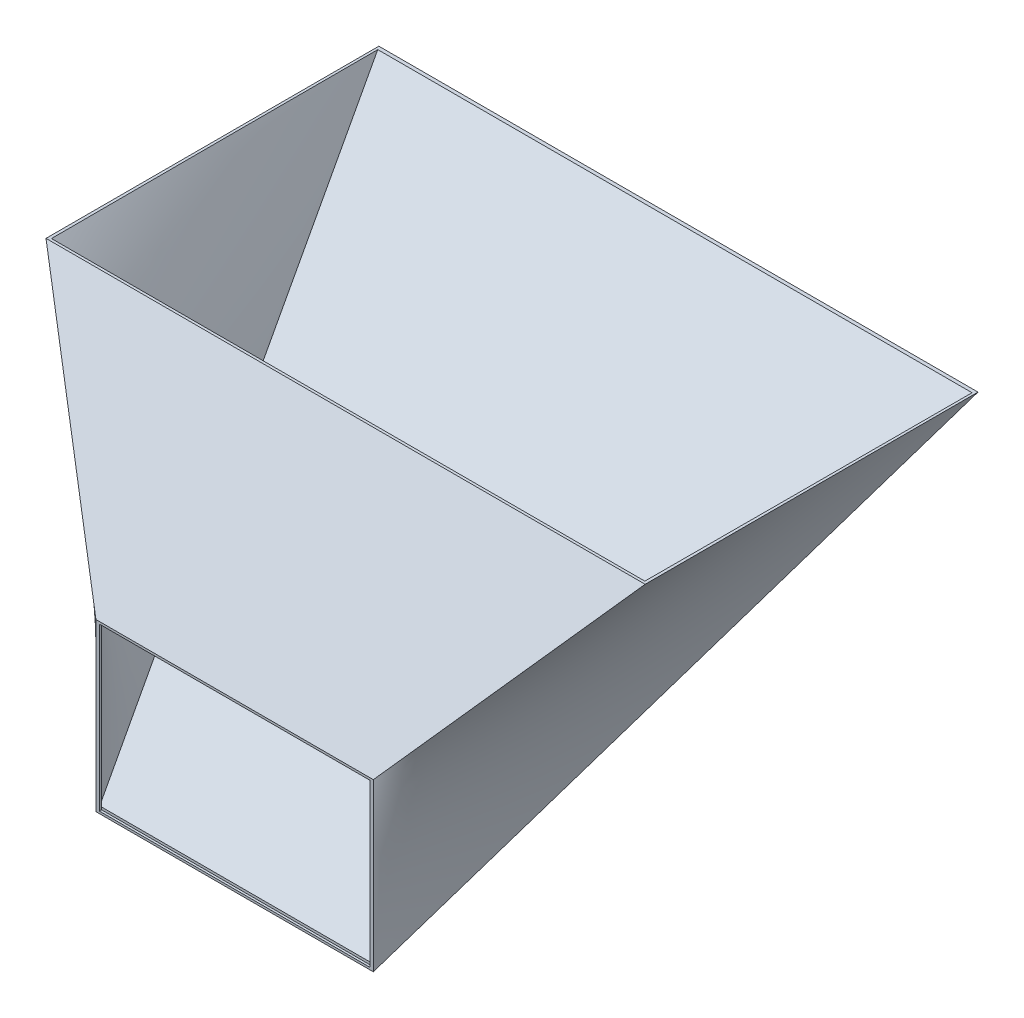
ISO-10303-21;
HEADER;
FILE_DESCRIPTION(('STEP AP214'),'2;1');
FILE_NAME('part.step','',(''),(''),'','','');
FILE_SCHEMA(('AUTOMOTIVE_DESIGN { 1 0 10303 214 1 1 1 1 }'));
ENDSEC;
DATA;
#1=APPLICATION_CONTEXT('core data for automotive mechanical design processes');
#2=APPLICATION_PROTOCOL_DEFINITION('international standard','automotive_design',2000,#1);
#3=PRODUCT_CONTEXT('',#1,'mechanical');
#4=PRODUCT('Part','Part','',(#3));
#5=PRODUCT_RELATED_PRODUCT_CATEGORY('part','',(#4));
#6=PRODUCT_DEFINITION_FORMATION('','',#4);
#7=PRODUCT_DEFINITION_CONTEXT('part definition',#1,'design');
#8=PRODUCT_DEFINITION('design','',#6,#7);
#9=PRODUCT_DEFINITION_SHAPE('','',#8);
#10=(LENGTH_UNIT() NAMED_UNIT(*) SI_UNIT(.MILLI.,.METRE.));
#11=(NAMED_UNIT(*) PLANE_ANGLE_UNIT() SI_UNIT($,.RADIAN.));
#12=(NAMED_UNIT(*) SI_UNIT($,.STERADIAN.) SOLID_ANGLE_UNIT());
#13=UNCERTAINTY_MEASURE_WITH_UNIT(LENGTH_MEASURE(1.E-05),#10,'distance_accuracy_value','');
#14=(GEOMETRIC_REPRESENTATION_CONTEXT(3) GLOBAL_UNCERTAINTY_ASSIGNED_CONTEXT((#13)) GLOBAL_UNIT_ASSIGNED_CONTEXT((#10,
#11,#12)) REPRESENTATION_CONTEXT('',''));
#15=CARTESIAN_POINT('',(0.,0.,0.));
#16=DIRECTION('',(0.,0.,1.));
#17=DIRECTION('',(1.,0.,0.));
#18=AXIS2_PLACEMENT_3D('',#15,#16,#17);
#19=CARTESIAN_POINT('',(0.,0.,0.));
#20=DIRECTION('',(0.,-1.,0.));
#21=DIRECTION('',(0.,0.,-1.));
#22=AXIS2_PLACEMENT_3D('',#19,#20,#21);
#23=PLANE('',#22);
#24=DIRECTION('',(0.,0.,-1.));
#25=VECTOR('',#24,1.);
#26=CARTESIAN_POINT('',(270.,0.,150.));
#27=LINE('',#26,#25);
#28=CARTESIAN_POINT('',(270.,0.,150.));
#29=VERTEX_POINT('',#28);
#30=CARTESIAN_POINT('',(270.,0.,-150.));
#31=VERTEX_POINT('',#30);
#32=EDGE_CURVE('E217',#29,#31,#27,.T.);
#33=ORIENTED_EDGE('',*,*,#32,.T.);
#34=DIRECTION('',(-1.,0.,0.));
#35=VECTOR('',#34,1.);
#36=CARTESIAN_POINT('',(-270.,0.,-150.));
#37=LINE('',#36,#35);
#38=CARTESIAN_POINT('',(-270.,0.,-150.));
#39=VERTEX_POINT('',#38);
#40=EDGE_CURVE('E361',#31,#39,#37,.T.);
#41=ORIENTED_EDGE('',*,*,#40,.T.);
#42=DIRECTION('',(0.,0.,1.));
#43=VECTOR('',#42,1.);
#44=CARTESIAN_POINT('',(-270.,0.,150.));
#45=LINE('',#44,#43);
#46=CARTESIAN_POINT('',(-270.,0.,150.));
#47=VERTEX_POINT('',#46);
#48=EDGE_CURVE('E592',#39,#47,#45,.T.);
#49=ORIENTED_EDGE('',*,*,#48,.T.);
#50=DIRECTION('',(1.,0.,0.));
#51=VECTOR('',#50,1.);
#52=CARTESIAN_POINT('',(-270.,0.,150.));
#53=LINE('',#52,#51);
#54=EDGE_CURVE('E286',#47,#29,#53,.T.);
#55=ORIENTED_EDGE('',*,*,#54,.T.);
#56=EDGE_LOOP('',(#33,#41,#49,#55));
#57=FACE_BOUND('',#56,.T.);
#58=CARTESIAN_POINT('',(267.411756298249,0.,147.6964977862));
#59=CARTESIAN_POINT('',(267.434846643851,0.,139.897678665111));
#60=CARTESIAN_POINT('',(267.455997240212,0.,132.098854111055));
#61=CARTESIAN_POINT('',(267.495069056526,0.,116.501197321535));
#62=CARTESIAN_POINT('',(267.512990276668,0.,108.702365086072));
#63=CARTESIAN_POINT('',(267.546253461856,0.,93.1046967574938));
#64=CARTESIAN_POINT('',(267.561595427414,0.,85.3058606643799));
#65=CARTESIAN_POINT('',(267.5901560998,0.,69.7081844888913));
#66=CARTESIAN_POINT('',(267.603374806591,0.,61.9093444065165));
#67=CARTESIAN_POINT('',(267.642244846355,0.,37.3656118596017));
#68=CARTESIAN_POINT('',(267.664763965878,0.,20.6207144494967));
#69=CARTESIAN_POINT('',(267.704377602569,0.,-12.8690880773957));
#70=CARTESIAN_POINT('',(267.721472119209,0.,-29.6139931941837));
#71=CARTESIAN_POINT('',(267.75182535049,0.,-63.1038122885919));
#72=CARTESIAN_POINT('',(267.765084063886,0.,-79.8487262662132));
#73=CARTESIAN_POINT('',(267.782886903814,0.,-104.966097303276));
#74=CARTESIAN_POINT('',(267.788473645064,0.,-113.338553655206));
#75=CARTESIAN_POINT('',(267.799043882002,0.,-130.083466718732));
#76=CARTESIAN_POINT('',(267.804027377692,0.,-138.455923430327));
#77=CARTESIAN_POINT('',(267.808755165928,0.,-146.828380287986));
#78=B_SPLINE_CURVE_WITH_KNOTS('',3,(#58,#59,#60,#61,#62,#63,#64,#65,#66,#67,#68,#69,#70,#71,#72,
#73,#74,#75,#76,#77),.UNSPECIFIED.,.F.,.F.,(4,2,2,2,2,2,2,2,2,4),(0.,23.3965592214482,
46.7931170839477,70.1896703108709,93.5862239371942,143.820960065194,194.055701082651,
244.290458415864,269.4078330493,294.525207616022),.UNSPECIFIED.);
#79=CARTESIAN_POINT('',(267.411756298249,0.,147.6964977862));
#80=VERTEX_POINT('',#79);
#81=CARTESIAN_POINT('',(267.808755165928,0.,-146.828380287986));
#82=VERTEX_POINT('',#81);
#83=EDGE_CURVE('E178',#80,#82,#78,.T.);
#84=ORIENTED_EDGE('',*,*,#83,.F.);
#85=DIRECTION('',(1.,0.,0.));
#86=VECTOR('',#85,1.);
#87=CARTESIAN_POINT('',(0.,0.,147.6964977862));
#88=LINE('',#87,#86);
#89=CARTESIAN_POINT('',(-267.411756298249,0.,147.6964977862));
#90=VERTEX_POINT('',#89);
#91=EDGE_CURVE('E227',#90,#80,#88,.T.);
#92=ORIENTED_EDGE('',*,*,#91,.F.);
#93=CARTESIAN_POINT('',(-267.808755165928,0.,-146.828380287986));
#94=CARTESIAN_POINT('',(-267.804134333256,0.,-138.647128529101));
#95=CARTESIAN_POINT('',(-267.799270860808,0.,-130.465876900697));
#96=CARTESIAN_POINT('',(-267.788969943614,0.,-114.103374012104));
#97=CARTESIAN_POINT('',(-267.783532498869,0.,-105.922122751915));
#98=CARTESIAN_POINT('',(-267.771994944348,0.,-89.5596207203461));
#99=CARTESIAN_POINT('',(-267.765894834573,0.,-81.3783699489672));
#100=CARTESIAN_POINT('',(-267.752920109484,0.,-65.0158713512886));
#101=CARTESIAN_POINT('',(-267.74604549439,0.,-56.8346235249888));
#102=CARTESIAN_POINT('',(-267.731387054738,0.,-40.4721286503037));
#103=CARTESIAN_POINT('',(-267.723603230176,0.,-32.2908816019184));
#104=CARTESIAN_POINT('',(-267.706960944255,0.,-15.9283884652603));
#105=CARTESIAN_POINT('',(-267.698102482879,0.,-7.74714237698738));
#106=CARTESIAN_POINT('',(-267.679106682879,0.,8.61535597827035));
#107=CARTESIAN_POINT('',(-267.668969343059,0.,16.7966082452539));
#108=CARTESIAN_POINT('',(-267.647160753254,0.,33.1591106511168));
#109=CARTESIAN_POINT('',(-267.635489503288,0.,41.3403607899962));
#110=CARTESIAN_POINT('',(-267.610293072754,0.,57.702857952949));
#111=CARTESIAN_POINT('',(-267.596767892252,0.,65.8841049770225));
#112=CARTESIAN_POINT('',(-267.567451362068,0.,82.2465972368752));
#113=CARTESIAN_POINT('',(-267.551660011764,0.,90.4278424726534));
#114=CARTESIAN_POINT('',(-267.517296777922,0.,106.790327473792));
#115=CARTESIAN_POINT('',(-267.498724894297,0.,114.971567239153));
#116=CARTESIAN_POINT('',(-267.458063294715,0.,131.334039242769));
#117=CARTESIAN_POINT('',(-267.435973578213,0.,139.515271481024));
#118=CARTESIAN_POINT('',(-267.411756298249,0.,147.6964977862));
#119=B_SPLINE_CURVE_WITH_KNOTS('',3,(#93,#94,#95,#96,#97,#98,#99,#100,#101,#102,#103,#104,#105,
#106,#107,#108,#109,#110,#111,#112,#113,#114,#115,#116,#117,#118),.UNSPECIFIED.,.F.,.F.,(4,2,2,
2,2,2,2,2,2,2,2,2,4),(0.,24.5437591976562,49.087518377804,73.6312774828969,98.1750295842546,
122.718781778726,147.26253434819,171.806309871532,196.350085093989,220.893859443495,
245.437640523055,269.981422361879,294.525208003884),.UNSPECIFIED.);
#120=CARTESIAN_POINT('',(-267.808755165928,0.,-146.828380287986));
#121=VERTEX_POINT('',#120);
#122=EDGE_CURVE('E258',#121,#90,#119,.T.);
#123=ORIENTED_EDGE('',*,*,#122,.F.);
#124=DIRECTION('',(-1.,0.,0.));
#125=VECTOR('',#124,1.);
#126=CARTESIAN_POINT('',(0.,0.,-146.828380287986));
#127=LINE('',#126,#125);
#128=EDGE_CURVE('E266',#82,#121,#127,.T.);
#129=ORIENTED_EDGE('',*,*,#128,.F.);
#130=EDGE_LOOP('',(#84,#92,#123,#129));
#131=FACE_BOUND('',#130,.T.);
#132=ADVANCED_FACE('F42',(#57,#131),#23,.F.);
#133=CARTESIAN_POINT('',(0.,0.,250.));
#134=DIRECTION('',(0.,0.,-1.));
#135=DIRECTION('',(-1.,0.,0.));
#136=AXIS2_PLACEMENT_3D('',#133,#134,#135);
#137=PLANE('',#136);
#138=DIRECTION('',(-1.,0.,0.));
#139=VECTOR('',#138,1.);
#140=CARTESIAN_POINT('',(-122.,-176.999999999998,250.));
#141=LINE('',#140,#139);
#142=CARTESIAN_POINT('',(122.,-176.999999999998,250.));
#143=VERTEX_POINT('',#142);
#144=CARTESIAN_POINT('',(-122.,-176.999999999998,250.));
#145=VERTEX_POINT('',#144);
#146=EDGE_CURVE('E172',#143,#145,#141,.T.);
#147=ORIENTED_EDGE('',*,*,#146,.F.);
#148=DIRECTION('',(0.,1.,0.));
#149=VECTOR('',#148,1.);
#150=CARTESIAN_POINT('',(122.,-322.999999999997,250.));
#151=LINE('',#150,#149);
#152=CARTESIAN_POINT('',(122.,-322.999999999997,250.));
#153=VERTEX_POINT('',#152);
#154=EDGE_CURVE('E61',#153,#143,#151,.T.);
#155=ORIENTED_EDGE('',*,*,#154,.F.);
#156=DIRECTION('',(1.,0.,0.));
#157=VECTOR('',#156,1.);
#158=CARTESIAN_POINT('',(-122.,-322.999999999997,250.));
#159=LINE('',#158,#157);
#160=CARTESIAN_POINT('',(-122.,-322.999999999997,250.));
#161=VERTEX_POINT('',#160);
#162=EDGE_CURVE('E162',#161,#153,#159,.T.);
#163=ORIENTED_EDGE('',*,*,#162,.F.);
#164=DIRECTION('',(0.,-1.,0.));
#165=VECTOR('',#164,1.);
#166=CARTESIAN_POINT('',(-122.,-322.999999999997,250.));
#167=LINE('',#166,#165);
#168=EDGE_CURVE('E165',#145,#161,#167,.T.);
#169=ORIENTED_EDGE('',*,*,#168,.F.);
#170=EDGE_LOOP('',(#147,#155,#163,#169));
#171=FACE_BOUND('',#170,.T.);
#172=DIRECTION('',(0.,1.,0.));
#173=VECTOR('',#172,1.);
#174=CARTESIAN_POINT('',(125.,-324.999999999997,250.));
#175=LINE('',#174,#173);
#176=CARTESIAN_POINT('',(125.,-324.999999999997,250.));
#177=VERTEX_POINT('',#176);
#178=CARTESIAN_POINT('',(125.,-174.999999999998,250.));
#179=VERTEX_POINT('',#178);
#180=EDGE_CURVE('E372',#177,#179,#175,.T.);
#181=ORIENTED_EDGE('',*,*,#180,.T.);
#182=DIRECTION('',(-1.,0.,0.));
#183=VECTOR('',#182,1.);
#184=CARTESIAN_POINT('',(-125.,-174.999999999997,250.));
#185=LINE('',#184,#183);
#186=CARTESIAN_POINT('',(-125.,-174.999999999997,250.));
#187=VERTEX_POINT('',#186);
#188=EDGE_CURVE('E409',#179,#187,#185,.T.);
#189=ORIENTED_EDGE('',*,*,#188,.T.);
#190=DIRECTION('',(0.,-1.,0.));
#191=VECTOR('',#190,1.);
#192=CARTESIAN_POINT('',(-125.,-324.999999999997,250.));
#193=LINE('',#192,#191);
#194=CARTESIAN_POINT('',(-125.,-324.999999999997,250.));
#195=VERTEX_POINT('',#194);
#196=EDGE_CURVE('E53',#187,#195,#193,.T.);
#197=ORIENTED_EDGE('',*,*,#196,.T.);
#198=DIRECTION('',(1.,0.,0.));
#199=VECTOR('',#198,1.);
#200=CARTESIAN_POINT('',(-125.,-324.999999999997,250.));
#201=LINE('',#200,#199);
#202=EDGE_CURVE('E12',#195,#177,#201,.T.);
#203=ORIENTED_EDGE('',*,*,#202,.T.);
#204=EDGE_LOOP('',(#181,#189,#197,#203));
#205=FACE_BOUND('',#204,.T.);
#206=ADVANCED_FACE('F44',(#171,#205),#137,.F.);
#207=CARTESIAN_POINT('',(0.,64.6153846153851,113.076923076922));
#208=DIRECTION('',(0.,-0.496138938356839,-0.868243142124456));
#209=DIRECTION('',(0.,0.868243142124456,-0.496138938356839));
#210=AXIS2_PLACEMENT_3D('',#207,#208,#209);
#211=PLANE('',#210);
#212=DIRECTION('',(0.583984690219175,-0.704809108885201,0.402748062220121));
#213=VECTOR('',#212,1.);
#214=CARTESIAN_POINT('',(-270.,0.,150.));
#215=LINE('',#214,#213);
#216=EDGE_CURVE('E291',#47,#187,#215,.T.);
#217=ORIENTED_EDGE('',*,*,#216,.T.);
#218=ORIENTED_EDGE('',*,*,#188,.F.);
#219=DIRECTION('',(-0.583984690219175,-0.704809108885201,0.402748062220121));
#220=VECTOR('',#219,1.);
#221=CARTESIAN_POINT('',(270.,0.,150.));
#222=LINE('',#221,#220);
#223=EDGE_CURVE('E353',#29,#179,#222,.T.);
#224=ORIENTED_EDGE('',*,*,#223,.F.);
#225=ORIENTED_EDGE('',*,*,#54,.F.);
#226=EDGE_LOOP('',(#217,#218,#224,#225));
#227=FACE_BOUND('',#226,.T.);
#228=ADVANCED_FACE('F293',(#227),#211,.F.);
#229=CARTESIAN_POINT('',(270.,0.,-150.));
#230=CARTESIAN_POINT('',(125.,-324.999999999997,250.));
#231=CARTESIAN_POINT('',(270.,0.,-100.));
#232=CARTESIAN_POINT('',(125.,-299.999999999998,250.));
#233=CARTESIAN_POINT('',(270.,0.,-50.0000000000001));
#234=CARTESIAN_POINT('',(125.,-274.999999999998,250.));
#235=CARTESIAN_POINT('',(270.,0.,49.9999999999999));
#236=CARTESIAN_POINT('',(125.,-224.999999999998,250.));
#237=CARTESIAN_POINT('',(270.,0.,99.9999999999999));
#238=CARTESIAN_POINT('',(125.,-199.999999999998,250.));
#239=CARTESIAN_POINT('',(270.,0.,150.));
#240=CARTESIAN_POINT('',(125.,-174.999999999997,250.));
#241=B_SPLINE_SURFACE_WITH_KNOTS('',3,1,((#229,#230),(#231,#232),(#233,#234),(#235,#236),(#237,
#238),(#239,#240)),.UNSPECIFIED.,.F.,.F.,.F.,(4,2,4),(2,2),(0.,0.5,1.),(0.,1.),.UNSPECIFIED.);
#242=DIRECTION('',(-0.270827043762255,-0.607026132570567,0.747109086240703));
#243=VECTOR('',#242,1.);
#244=CARTESIAN_POINT('',(270.,0.,-150.));
#245=LINE('',#244,#243);
#246=EDGE_CURVE('E352',#31,#177,#245,.T.);
#247=ORIENTED_EDGE('',*,*,#32,.F.);
#248=ORIENTED_EDGE('',*,*,#223,.T.);
#249=ORIENTED_EDGE('',*,*,#180,.F.);
#250=ORIENTED_EDGE('',*,*,#246,.F.);
#251=EDGE_LOOP('',(#247,#248,#249,#250));
#252=FACE_BOUND('',#251,.T.);
#253=ADVANCED_FACE('F271',(#252),#241,.T.);
#254=CARTESIAN_POINT('',(-270.,0.,150.));
#255=CARTESIAN_POINT('',(-125.,-174.999999999997,250.));
#256=CARTESIAN_POINT('',(-270.,0.,100.));
#257=CARTESIAN_POINT('',(-125.,-199.999999999998,250.));
#258=CARTESIAN_POINT('',(-270.,0.,50.));
#259=CARTESIAN_POINT('',(-125.,-224.999999999998,250.));
#260=CARTESIAN_POINT('',(-270.,0.,-50.));
#261=CARTESIAN_POINT('',(-125.,-274.999999999998,250.));
#262=CARTESIAN_POINT('',(-270.,0.,-100.));
#263=CARTESIAN_POINT('',(-125.,-299.999999999998,250.));
#264=CARTESIAN_POINT('',(-270.,0.,-150.));
#265=CARTESIAN_POINT('',(-125.,-324.999999999997,250.));
#266=B_SPLINE_SURFACE_WITH_KNOTS('',3,1,((#254,#255),(#256,#257),(#258,#259),(#260,#261),(#262,
#263),(#264,#265)),.UNSPECIFIED.,.F.,.F.,.F.,(4,2,4),(2,2),(0.,0.5,1.),(0.,1.),.UNSPECIFIED.);
#267=DIRECTION('',(0.270827043762255,-0.607026132570567,0.747109086240703));
#268=VECTOR('',#267,1.);
#269=CARTESIAN_POINT('',(-197.5,-162.499999999999,50.));
#270=LINE('',#269,#268);
#271=EDGE_CURVE('E345',#39,#195,#270,.T.);
#272=ORIENTED_EDGE('',*,*,#48,.F.);
#273=ORIENTED_EDGE('',*,*,#271,.T.);
#274=ORIENTED_EDGE('',*,*,#196,.F.);
#275=ORIENTED_EDGE('',*,*,#216,.F.);
#276=EDGE_LOOP('',(#272,#273,#274,#275));
#277=FACE_BOUND('',#276,.T.);
#278=ADVANCED_FACE('F322',(#277),#266,.T.);
#279=CARTESIAN_POINT('',(0.,-73.4117647058823,-59.6470588235289));
#280=DIRECTION('',(0.,0.776114000116268,0.630592625094463));
#281=DIRECTION('',(0.,-0.630592625094463,0.776114000116268));
#282=AXIS2_PLACEMENT_3D('',#279,#280,#281);
#283=PLANE('',#282);
#284=ORIENTED_EDGE('',*,*,#246,.T.);
#285=ORIENTED_EDGE('',*,*,#202,.F.);
#286=ORIENTED_EDGE('',*,*,#271,.F.);
#287=ORIENTED_EDGE('',*,*,#40,.F.);
#288=EDGE_LOOP('',(#284,#285,#286,#287));
#289=FACE_BOUND('',#288,.T.);
#290=ADVANCED_FACE('F202',(#289),#283,.F.);
#291=CARTESIAN_POINT('',(0.,0.,248.));
#292=DIRECTION('',(0.,0.,-1.));
#293=DIRECTION('',(-1.,0.,0.));
#294=AXIS2_PLACEMENT_3D('',#291,#292,#293);
#295=PLANE('',#294);
#296=DIRECTION('',(0.,1.,0.));
#297=VECTOR('',#296,1.);
#298=CARTESIAN_POINT('',(122.,-322.999999999997,248.));
#299=LINE('',#298,#297);
#300=CARTESIAN_POINT('',(122.,-320.798058983986,248.));
#301=VERTEX_POINT('',#300);
#302=CARTESIAN_POINT('',(122.,-176.999999999998,248.));
#303=VERTEX_POINT('',#302);
#304=EDGE_CURVE('E142',#301,#303,#299,.T.);
#305=ORIENTED_EDGE('',*,*,#304,.T.);
#306=DIRECTION('',(-1.,0.,0.));
#307=VECTOR('',#306,1.);
#308=CARTESIAN_POINT('',(-122.,-176.999999999998,248.));
#309=LINE('',#308,#307);
#310=CARTESIAN_POINT('',(-122.,-176.999999999998,248.));
#311=VERTEX_POINT('',#310);
#312=EDGE_CURVE('E151',#303,#311,#309,.T.);
#313=ORIENTED_EDGE('',*,*,#312,.T.);
#314=DIRECTION('',(0.,-1.,0.));
#315=VECTOR('',#314,1.);
#316=CARTESIAN_POINT('',(-122.,-322.999999999997,248.));
#317=LINE('',#316,#315);
#318=CARTESIAN_POINT('',(-122.,-320.798058983986,248.));
#319=VERTEX_POINT('',#318);
#320=EDGE_CURVE('E168',#311,#319,#317,.T.);
#321=ORIENTED_EDGE('',*,*,#320,.T.);
#322=DIRECTION('',(1.,0.,0.));
#323=VECTOR('',#322,1.);
#324=CARTESIAN_POINT('',(0.,-320.798058983986,248.));
#325=LINE('',#324,#323);
#326=CARTESIAN_POINT('',(-123.605215125509,-320.798058983986,248.));
#327=VERTEX_POINT('',#326);
#328=EDGE_CURVE('E214',#327,#319,#325,.T.);
#329=ORIENTED_EDGE('',*,*,#328,.F.);
#330=CARTESIAN_POINT('',(-124.365259815684,-175.531128874147,248.));
#331=CARTESIAN_POINT('',(-124.328099579039,-179.160641786396,248.));
#332=CARTESIAN_POINT('',(-124.293082813377,-182.790176092988,248.));
#333=CARTESIAN_POINT('',(-124.226973659055,-190.049279416056,248.));
#334=CARTESIAN_POINT('',(-124.195881269212,-193.67884843252,248.));
#335=CARTESIAN_POINT('',(-124.107946895652,-204.567584982609,248.));
#336=CARTESIAN_POINT('',(-124.05644757007,-211.826795747455,248.));
#337=CARTESIAN_POINT('',(-123.964349647355,-226.345275370649,248.));
#338=CARTESIAN_POINT('',(-123.923751036982,-233.604544228916,248.));
#339=CARTESIAN_POINT('',(-123.850686066089,-248.123128953765,248.));
#340=CARTESIAN_POINT('',(-123.81821971312,-255.382444820383,248.));
#341=CARTESIAN_POINT('',(-123.769164027476,-267.488119495402,248.));
#342=CARTESIAN_POINT('',(-123.750884357462,-272.334471649066,248.));
#343=CARTESIAN_POINT('',(-123.716588829711,-282.027184119453,248.));
#344=CARTESIAN_POINT('',(-123.700572972047,-286.873544436176,248.));
#345=CARTESIAN_POINT('',(-123.670426011759,-296.566261566098,248.));
#346=CARTESIAN_POINT('',(-123.656294905519,-301.412618379287,248.));
#347=CARTESIAN_POINT('',(-123.629629444561,-311.105335952212,248.));
#348=CARTESIAN_POINT('',(-123.617095089689,-315.951696711949,248.));
#349=CARTESIAN_POINT('',(-123.605215125509,-320.798058983986,248.));
#350=B_SPLINE_CURVE_WITH_KNOTS('',3,(#330,#331,#332,#333,#334,#335,#336,#337,#338,#339,#340,
#341,#342,#343,#344,#345,#346,#347,#348,#349),.UNSPECIFIED.,.F.,.F.,(4,2,2,2,2,2,2,2,2,4),(0.,
10.8891079150919,21.7782125452057,43.5563806118691,65.3345222285689,87.1126840730327,
101.651843467233,116.191003329456,130.730135303088,145.269265890549),.UNSPECIFIED.);
#351=CARTESIAN_POINT('',(-124.365259815684,-175.531128874147,248.));
#352=VERTEX_POINT('',#351);
#353=EDGE_CURVE('E207',#352,#327,#350,.T.);
#354=ORIENTED_EDGE('',*,*,#353,.F.);
#355=DIRECTION('',(-1.,0.,0.));
#356=VECTOR('',#355,1.);
#357=CARTESIAN_POINT('',(0.,-175.531128874147,248.));
#358=LINE('',#357,#356);
#359=CARTESIAN_POINT('',(124.365259815684,-175.531128874147,248.));
#360=VERTEX_POINT('',#359);
#361=EDGE_CURVE('E191',#360,#352,#358,.T.);
#362=ORIENTED_EDGE('',*,*,#361,.F.);
#363=CARTESIAN_POINT('',(123.605215125509,-320.798058983986,248.));
#364=CARTESIAN_POINT('',(123.614768387001,-316.89864838447,248.));
#365=CARTESIAN_POINT('',(123.624752104755,-312.999238835381,248.));
#366=CARTESIAN_POINT('',(123.645718520142,-305.200422311509,248.));
#367=CARTESIAN_POINT('',(123.656701217803,-301.301015336727,248.));
#368=CARTESIAN_POINT('',(123.691354915018,-289.602787782247,248.));
#369=CARTESIAN_POINT('',(123.716731491314,-281.803972125973,248.));
#370=CARTESIAN_POINT('',(123.775027287759,-265.798908204825,248.));
#371=CARTESIAN_POINT('',(123.808271310441,-257.592661093171,248.));
#372=CARTESIAN_POINT('',(123.884010988496,-241.180216219091,248.));
#373=CARTESIAN_POINT('',(123.926506635373,-232.974018456627,248.));
#374=CARTESIAN_POINT('',(124.024391596907,-216.561627836242,248.));
#375=CARTESIAN_POINT('',(124.079781019693,-208.35543497894,248.));
#376=CARTESIAN_POINT('',(124.176093764621,-196.046240389759,248.));
#377=CARTESIAN_POINT('',(124.210402825031,-191.943186933849,248.));
#378=CARTESIAN_POINT('',(124.283977326941,-183.737122841055,248.));
#379=CARTESIAN_POINT('',(124.323242770528,-179.634112204189,248.));
#380=CARTESIAN_POINT('',(124.365259815684,-175.531128874147,248.));
#381=B_SPLINE_CURVE_WITH_KNOTS('',3,(#363,#364,#365,#366,#367,#368,#369,#370,#371,#372,#373,
#374,#375,#376,#377,#378,#379,#380),.UNSPECIFIED.,.F.,.F.,(4,2,2,2,2,2,2,2,4),(0.,
11.6982668709995,23.3965340937663,46.7931032000601,71.4120427323906,96.03095965179,
120.65008303564,132.959670982672,145.269264117559),.UNSPECIFIED.);
#382=CARTESIAN_POINT('',(123.605215125509,-320.798058983986,248.));
#383=VERTEX_POINT('',#382);
#384=EDGE_CURVE('E182',#383,#360,#381,.T.);
#385=ORIENTED_EDGE('',*,*,#384,.F.);
#386=EDGE_CURVE('E160',#301,#383,#325,.T.);
#387=ORIENTED_EDGE('',*,*,#386,.F.);
#388=EDGE_LOOP('',(#305,#313,#321,#329,#354,#362,#385,#387));
#389=FACE_BOUND('',#388,.T.);
#390=ADVANCED_FACE('F158',(#389),#295,.T.);
#391=CARTESIAN_POINT('',(0.,63.6231067386714,111.340436792673));
#392=DIRECTION('',(0.,-0.496138938356839,-0.868243142124456));
#393=DIRECTION('',(0.,0.868243142124456,-0.496138938356839));
#394=AXIS2_PLACEMENT_3D('',#391,#392,#393);
#395=PLANE('',#394);
#396=CARTESIAN_POINT('',(-267.411756298249,0.,147.6964977862));
#397=CARTESIAN_POINT('',(-263.947872468851,-4.21704453046515,150.106237517895));
#398=CARTESIAN_POINT('',(-260.484818623001,-8.43460311679031,152.516270995795));
#399=CARTESIAN_POINT('',(-253.560595691183,-16.8708869204727,157.337004597899));
#400=CARTESIAN_POINT('',(-250.099426605361,-21.0896121379195,159.747704722155));
#401=CARTESIAN_POINT('',(-243.179197067745,-29.5283688445704,164.569851411669));
#402=CARTESIAN_POINT('',(-239.720136616837,-33.7484003343215,166.981297977242));
#403=CARTESIAN_POINT('',(-232.8043851383,-42.1899265224019,171.805027227573));
#404=CARTESIAN_POINT('',(-229.347694110606,-46.4114212206898,174.217309912309));
#405=CARTESIAN_POINT('',(-222.436962316815,-54.8560488337265,179.042811405473));
#406=CARTESIAN_POINT('',(-218.982921552036,-59.0791817492882,181.456030214366));
#407=CARTESIAN_POINT('',(-212.077793730281,-67.5272678539298,186.283507988447));
#408=CARTESIAN_POINT('',(-208.62670667341,-71.7522210430743,188.697766953672));
#409=CARTESIAN_POINT('',(-201.727792072948,-80.2041320210984,193.527430369686));
#410=CARTESIAN_POINT('',(-198.27996452876,-84.4310898096102,195.942834820264));
#411=CARTESIAN_POINT('',(-191.387847322925,-92.8871786301398,200.774885574852));
#412=CARTESIAN_POINT('',(-187.94355766095,-97.1163096619564,203.191531878748));
#413=CARTESIAN_POINT('',(-181.151637262315,-105.46267251443,207.960882080161));
#414=CARTESIAN_POINT('',(-177.803907056101,-109.579843314892,210.313551108997));
#415=CARTESIAN_POINT('',(-171.112012560915,-117.816369678818,215.020137602669));
#416=CARTESIAN_POINT('',(-167.767848272381,-121.935725242549,217.374055067658));
#417=CARTESIAN_POINT('',(-161.082851137861,-130.176475177818,222.083055030669));
#418=CARTESIAN_POINT('',(-157.742018292775,-134.297869549906,224.438137529005));
#419=CARTESIAN_POINT('',(-151.063039825605,-142.542306197461,229.149244184751));
#420=CARTESIAN_POINT('',(-147.72489420659,-146.665348474803,231.505268343232));
#421=CARTESIAN_POINT('',(-141.050119748504,-154.912357076316,236.217844686953));
#422=CARTESIAN_POINT('',(-137.713490909141,-159.036323400308,238.574396872092));
#423=CARTESIAN_POINT('',(-132.708395153399,-165.222177670479,242.109170740761));
#424=CARTESIAN_POINT('',(-131.040005082313,-167.284112486864,243.287419207267));
#425=CARTESIAN_POINT('',(-127.702922288601,-171.407797496956,245.643810641605));
#426=CARTESIAN_POINT('',(-126.034229565973,-173.469547690663,246.821953609438));
#427=CARTESIAN_POINT('',(-124.365259815684,-175.531128874147,248.));
#428=B_SPLINE_CURVE_WITH_KNOTS('',3,(#396,#397,#398,#399,#400,#401,#402,#403,#404,#405,#406,
#407,#408,#409,#410,#411,#412,#413,#414,#415,#416,#417,#418,#419,#420,#421,#422,#423,#424,#425,
#426,#427),.UNSPECIFIED.,.F.,.F.,(4,2,2,2,2,2,2,2,2,2,2,2,2,2,2,4),(0.,17.8969051775086,
35.7938117303442,53.6907257887175,71.5876393396852,89.4845617811341,107.381484857028,
125.278404650459,143.175322787894,160.589137502379,178.002954348652,195.416775887783,
212.830617285041,230.244455325678,238.951368115672,247.65828095177),.UNSPECIFIED.);
#429=EDGE_CURVE('E219',#90,#352,#428,.T.);
#430=ORIENTED_EDGE('',*,*,#429,.F.);
#431=ORIENTED_EDGE('',*,*,#91,.T.);
#432=CARTESIAN_POINT('',(267.411756298249,0.,147.6964977862));
#433=CARTESIAN_POINT('',(264.392872613141,-3.67528434848426,149.796660271049));
#434=CARTESIAN_POINT('',(261.374621075922,-7.35096019744373,151.897046470454));
#435=CARTESIAN_POINT('',(255.339527763022,-14.7031853251864,156.098317972021));
#436=CARTESIAN_POINT('',(252.322685987617,-18.3797346041403,158.199203274281));
#437=CARTESIAN_POINT('',(246.290558648661,-25.7337958226645,162.40152397058));
#438=CARTESIAN_POINT('',(243.275273085212,-29.4113077622977,164.502959364656));
#439=CARTESIAN_POINT('',(237.246423973923,-36.7673958166314,168.706438252847));
#440=CARTESIAN_POINT('',(234.232860426155,-40.4459719313765,170.808481746987));
#441=CARTESIAN_POINT('',(228.207635543856,-47.804298078439,175.013239545309));
#442=CARTESIAN_POINT('',(225.195974209218,-51.4840481106909,177.115953849453));
#443=CARTESIAN_POINT('',(219.174747046229,-58.8448402273347,181.322120773249));
#444=CARTESIAN_POINT('',(216.165181217811,-62.5258823116847,183.425573392878));
#445=CARTESIAN_POINT('',(209.442187027695,-70.7535912282343,188.127121345192));
#446=CARTESIAN_POINT('',(205.72936115505,-75.3006292121789,190.725428764589));
#447=CARTESIAN_POINT('',(198.307587866209,-84.3970909129313,195.923406879305));
#448=CARTESIAN_POINT('',(194.598640450097,-88.9465146297903,198.523077574653));
#449=CARTESIAN_POINT('',(187.184946056581,-98.0479410437655,203.723892668353));
#450=CARTESIAN_POINT('',(183.480199078924,-102.599943740726,206.325037066616));
#451=CARTESIAN_POINT('',(176.075086005236,-111.706634136139,211.52886014971));
#452=CARTESIAN_POINT('',(172.374719908885,-116.261321834396,214.131538834427));
#453=CARTESIAN_POINT('',(166.210961282746,-123.854653938101,218.47058575083));
#454=CARTESIAN_POINT('',(163.746390009884,-126.892577125522,220.206541857928));
#455=CARTESIAN_POINT('',(158.818966319562,-132.969474384463,223.679054577323));
#456=CARTESIAN_POINT('',(156.356113902197,-136.008448456039,225.415611189653));
#457=CARTESIAN_POINT('',(151.431836015192,-142.08726849824,228.889222642338));
#458=CARTESIAN_POINT('',(148.970410545734,-145.127114468974,230.626277482758));
#459=CARTESIAN_POINT('',(144.048532050919,-151.207400598266,234.100726699496));
#460=CARTESIAN_POINT('',(141.588079025743,-154.247840756933,235.838121075878));
#461=CARTESIAN_POINT('',(136.667531544441,-160.328939257502,239.313034504774));
#462=CARTESIAN_POINT('',(134.207437088274,-163.369597599378,241.050553557275));
#463=CARTESIAN_POINT('',(129.286843297722,-169.450665831495,244.525449689913));
#464=CARTESIAN_POINT('',(126.826343963467,-172.491075721815,246.262826770096));
#465=CARTESIAN_POINT('',(124.365259815684,-175.531128874147,248.));
#466=B_SPLINE_CURVE_WITH_KNOTS('',3,(#432,#433,#434,#435,#436,#437,#438,#439,#440,#441,#442,
#443,#444,#445,#446,#447,#448,#449,#450,#451,#452,#453,#454,#455,#456,#457,#458,#459,#460,#461,
#462,#463,#464,#465),.UNSPECIFIED.,.F.,.F.,(4,2,2,2,2,2,2,2,2,2,2,2,2,2,2,2,4),(0.,
15.5977083901432,31.1954198325809,46.793132294236,62.3908454091562,77.9885576557088,
93.5862693979134,112.845200406738,132.104131829954,151.363062091252,170.621990944948,
183.461370946304,196.30075165433,209.140133995977,221.979518730347,234.818901994839,
247.658281125361),.UNSPECIFIED.);
#467=EDGE_CURVE('E226',#80,#360,#466,.T.);
#468=ORIENTED_EDGE('',*,*,#467,.T.);
#469=ORIENTED_EDGE('',*,*,#361,.T.);
#470=EDGE_LOOP('',(#430,#431,#468,#469));
#471=FACE_BOUND('',#470,.T.);
#472=ADVANCED_FACE('F201',(#471),#395,.T.);
#473=CARTESIAN_POINT('',(270.,0.,-150.));
#474=CARTESIAN_POINT('',(125.,-324.999999999997,250.));
#475=CARTESIAN_POINT('',(270.,0.,-100.));
#476=CARTESIAN_POINT('',(125.,-299.999999999998,250.));
#477=CARTESIAN_POINT('',(270.,0.,-50.0000000000001));
#478=CARTESIAN_POINT('',(125.,-274.999999999998,250.));
#479=CARTESIAN_POINT('',(270.,0.,49.9999999999999));
#480=CARTESIAN_POINT('',(125.,-224.999999999998,250.));
#481=CARTESIAN_POINT('',(270.,0.,99.9999999999999));
#482=CARTESIAN_POINT('',(125.,-199.999999999998,250.));
#483=CARTESIAN_POINT('',(270.,0.,150.));
#484=CARTESIAN_POINT('',(125.,-174.999999999997,250.));
#485=B_SPLINE_SURFACE_WITH_KNOTS('',3,1,((#473,#474),(#475,#476),(#477,#478),(#479,#480),(#481,
#482),(#483,#484)),.UNSPECIFIED.,.F.,.F.,.F.,(4,2,4),(2,2),(0.,0.5,1.),(0.,1.),.UNSPECIFIED.);
#486=OFFSET_SURFACE('',#485,-2.,.F.);
#487=ORIENTED_EDGE('',*,*,#83,.T.);
#488=CARTESIAN_POINT('',(267.808755165928,0.,-146.828380287986));
#489=CARTESIAN_POINT('',(263.571347375505,-9.46587592537828,-135.178071456752));
#490=CARTESIAN_POINT('',(259.333266179535,-18.9316319959445,-123.527910139131));
#491=CARTESIAN_POINT('',(250.855497884066,-37.8628582345235,-100.227939383957));
#492=CARTESIAN_POINT('',(246.615810784555,-47.3283284025342,-88.5781299464054));
#493=CARTESIAN_POINT('',(238.134570404431,-66.2589392882487,-65.2789165486028));
#494=CARTESIAN_POINT('',(233.89301712327,-75.724080005855,-53.6295125884719));
#495=CARTESIAN_POINT('',(225.407708222688,-94.6539688549586,-30.3311878511134));
#496=CARTESIAN_POINT('',(221.16395260327,-104.118716986457,-18.6822670738851));
#497=CARTESIAN_POINT('',(209.17156178663,-130.856276502467,14.2254984842822));
#498=CARTESIAN_POINT('',(201.419916685586,-148.128551206054,35.4836827348507));
#499=CARTESIAN_POINT('',(189.783510268523,-174.035365257877,67.3689923370943));
#500=CARTESIAN_POINT('',(185.903218633667,-182.670702944617,77.9971002592359));
#501=CARTESIAN_POINT('',(178.139079448838,-199.940742599174,99.2525336802299));
#502=CARTESIAN_POINT('',(174.255231898893,-208.575444566996,109.879859179088));
#503=CARTESIAN_POINT('',(166.483298298998,-225.84410282174,131.133592415695));
#504=CARTESIAN_POINT('',(162.595212243237,-234.478059107621,141.760000152165));
#505=CARTESIAN_POINT('',(154.813963644532,-251.745061792635,163.01169576449));
#506=CARTESIAN_POINT('',(150.920801101729,-260.378108191793,173.636983640377));
#507=CARTESIAN_POINT('',(143.128359048726,-277.643106666545,194.886212532379));
#508=CARTESIAN_POINT('',(139.229079536335,-286.275058741745,205.51015354801));
#509=CARTESIAN_POINT('',(133.374598800288,-299.221987254231,221.444834794147));
#510=CARTESIAN_POINT('',(131.422178214156,-303.537463703993,226.756190424623));
#511=CARTESIAN_POINT('',(127.515285126763,-312.168047326532,237.378447190825));
#512=CARTESIAN_POINT('',(125.560812625463,-316.483154499302,242.689348326542));
#513=CARTESIAN_POINT('',(123.605215125509,-320.798058983986,248.));
#514=B_SPLINE_CURVE_WITH_KNOTS('',3,(#488,#489,#490,#491,#492,#493,#494,#495,#496,#497,#498,
#499,#500,#501,#502,#503,#504,#505,#506,#507,#508,#509,#510,#511,#512,#513),.UNSPECIFIED.,.F.,
.F.,(4,2,2,2,2,2,2,2,2,2,2,2,4),(0.,46.7930887077822,93.5861777374024,140.379280487551,
187.172383180338,272.571261679933,315.270694369693,357.970126746788,400.669617741837,
443.369107550014,486.068612652674,507.418367305035,528.768122362899),.UNSPECIFIED.);
#515=EDGE_CURVE('E192',#82,#383,#514,.T.);
#516=ORIENTED_EDGE('',*,*,#515,.T.);
#517=ORIENTED_EDGE('',*,*,#384,.T.);
#518=ORIENTED_EDGE('',*,*,#467,.F.);
#519=EDGE_LOOP('',(#487,#516,#517,#518));
#520=FACE_BOUND('',#519,.T.);
#521=ADVANCED_FACE('F194',(#520),#486,.F.);
#522=CARTESIAN_POINT('',(-270.,0.,150.));
#523=CARTESIAN_POINT('',(-125.,-174.999999999997,250.));
#524=CARTESIAN_POINT('',(-270.,0.,100.));
#525=CARTESIAN_POINT('',(-125.,-199.999999999998,250.));
#526=CARTESIAN_POINT('',(-270.,0.,50.));
#527=CARTESIAN_POINT('',(-125.,-224.999999999998,250.));
#528=CARTESIAN_POINT('',(-270.,0.,-50.));
#529=CARTESIAN_POINT('',(-125.,-274.999999999998,250.));
#530=CARTESIAN_POINT('',(-270.,0.,-100.));
#531=CARTESIAN_POINT('',(-125.,-299.999999999998,250.));
#532=CARTESIAN_POINT('',(-270.,0.,-150.));
#533=CARTESIAN_POINT('',(-125.,-324.999999999997,250.));
#534=B_SPLINE_SURFACE_WITH_KNOTS('',3,1,((#522,#523),(#524,#525),(#526,#527),(#528,#529),(#530,
#531),(#532,#533)),.UNSPECIFIED.,.F.,.F.,.F.,(4,2,4),(2,2),(0.,0.5,1.),(0.,1.),.UNSPECIFIED.);
#535=OFFSET_SURFACE('',#534,-2.,.F.);
#536=ORIENTED_EDGE('',*,*,#122,.T.);
#537=ORIENTED_EDGE('',*,*,#429,.T.);
#538=ORIENTED_EDGE('',*,*,#353,.T.);
#539=CARTESIAN_POINT('',(-267.808755165928,0.,-146.828380287986));
#540=CARTESIAN_POINT('',(-264.567406072011,-7.2408069654614,-137.916617868957));
#541=CARTESIAN_POINT('',(-261.325657816577,-14.4815428784966,-129.004942899067));
#542=CARTESIAN_POINT('',(-254.841255735431,-28.9628534768032,-111.181791393459));
#543=CARTESIAN_POINT('',(-251.598601909717,-36.2034281620742,-102.270314857741));
#544=CARTESIAN_POINT('',(-241.869120358855,-57.9248835837951,-75.5362158771612));
#545=CARTESIAN_POINT('',(-235.380773427552,-72.4054937479657,-57.7139264443357));
#546=CARTESIAN_POINT('',(-222.398910409768,-101.365792886202,-22.0704813511209));
#547=CARTESIAN_POINT('',(-215.905394323247,-115.845481860262,-4.24932569074029));
#548=CARTESIAN_POINT('',(-206.160074102091,-137.564114199803,22.4812987271571));
#549=CARTESIAN_POINT('',(-202.910793169533,-144.803507777916,31.391321592527));
#550=CARTESIAN_POINT('',(-196.410295860613,-159.281949550606,49.2109422358385));
#551=CARTESIAN_POINT('',(-193.159079484215,-166.520997745177,58.1205400137721));
#552=CARTESIAN_POINT('',(-186.235624234606,-181.930836579701,77.0864955024172));
#553=CARTESIAN_POINT('',(-182.563080627544,-190.101572779374,87.1427862097072));
#554=CARTESIAN_POINT('',(-175.2146603456,-206.442449105549,107.254633995768));
#555=CARTESIAN_POINT('',(-171.538783670749,-214.612589232055,117.310191074545));
#556=CARTESIAN_POINT('',(-164.183089134508,-230.952163594406,137.420436443593));
#557=CARTESIAN_POINT('',(-160.503271273306,-239.121597830285,147.475124733905));
#558=CARTESIAN_POINT('',(-153.138950153316,-255.459630545774,167.583472691431));
#559=CARTESIAN_POINT('',(-149.454446892409,-263.628229025006,177.637132358177));
#560=CARTESIAN_POINT('',(-142.079849821221,-279.96442297233,197.743217216423));
#561=CARTESIAN_POINT('',(-138.389756010694,-288.13201844038,207.795642407868));
#562=CARTESIAN_POINT('',(-132.849581960163,-300.382507404201,222.873167286418));
#563=CARTESIAN_POINT('',(-131.002018187139,-304.465853461335,227.898823972122));
#564=CARTESIAN_POINT('',(-127.305043935458,-312.632213202391,237.949728268805));
#565=CARTESIAN_POINT('',(-125.455633456771,-316.715226886306,242.974975879778));
#566=CARTESIAN_POINT('',(-123.605215125509,-320.798058983986,248.));
#567=B_SPLINE_CURVE_WITH_KNOTS('',3,(#539,#540,#541,#542,#543,#544,#545,#546,#547,#548,#549,
#550,#551,#552,#553,#554,#555,#556,#557,#558,#559,#560,#561,#562,#563,#564,#565,#566),
.UNSPECIFIED.,.F.,.F.,(4,2,2,2,2,2,2,2,2,2,2,2,2,4),(0.,35.7938018268883,71.5876037298542,
143.17521711686,214.762831055857,250.556634582487,286.350438791672,326.753376477954,
367.156313781958,407.559249147167,447.962202787378,488.365158208338,508.56664029504,
528.76812271268),.UNSPECIFIED.);
#568=EDGE_CURVE('E251',#121,#327,#567,.T.);
#569=ORIENTED_EDGE('',*,*,#568,.F.);
#570=EDGE_LOOP('',(#536,#537,#538,#569));
#571=FACE_BOUND('',#570,.T.);
#572=ADVANCED_FACE('F203',(#571),#535,.F.);
#573=CARTESIAN_POINT('',(0.,-71.8595367056497,-58.3858735733399));
#574=DIRECTION('',(0.,0.776114000116268,0.630592625094463));
#575=DIRECTION('',(0.,-0.630592625094463,0.776114000116268));
#576=AXIS2_PLACEMENT_3D('',#573,#574,#575);
#577=PLANE('',#576);
#578=ORIENTED_EDGE('',*,*,#515,.F.);
#579=ORIENTED_EDGE('',*,*,#128,.T.);
#580=ORIENTED_EDGE('',*,*,#568,.T.);
#581=ORIENTED_EDGE('',*,*,#328,.T.);
#582=EDGE_CURVE('E218',#319,#301,#325,.T.);
#583=ORIENTED_EDGE('',*,*,#582,.T.);
#584=ORIENTED_EDGE('',*,*,#386,.T.);
#585=EDGE_LOOP('',(#578,#579,#580,#581,#583,#584));
#586=FACE_BOUND('',#585,.T.);
#587=ADVANCED_FACE('F237',(#586),#577,.T.);
#588=CARTESIAN_POINT('',(122.,-322.999999999997,248.));
#589=DIRECTION('',(1.,0.,0.));
#590=DIRECTION('',(0.,0.,-1.));
#591=AXIS2_PLACEMENT_3D('',#588,#589,#590);
#592=PLANE('',#591);
#593=ORIENTED_EDGE('',*,*,#154,.T.);
#594=DIRECTION('',(0.,0.,1.));
#595=VECTOR('',#594,1.);
#596=CARTESIAN_POINT('',(122.,-176.999999999998,248.));
#597=LINE('',#596,#595);
#598=EDGE_CURVE('E138',#303,#143,#597,.T.);
#599=ORIENTED_EDGE('',*,*,#598,.F.);
#600=ORIENTED_EDGE('',*,*,#304,.F.);
#601=CARTESIAN_POINT('',(122.,-322.999999999997,248.));
#602=VERTEX_POINT('',#601);
#603=EDGE_CURVE('E69',#602,#301,#299,.T.);
#604=ORIENTED_EDGE('',*,*,#603,.F.);
#605=DIRECTION('',(0.,0.,1.));
#606=VECTOR('',#605,1.);
#607=CARTESIAN_POINT('',(122.,-322.999999999997,248.));
#608=LINE('',#607,#606);
#609=EDGE_CURVE('E176',#602,#153,#608,.T.);
#610=ORIENTED_EDGE('',*,*,#609,.T.);
#611=EDGE_LOOP('',(#593,#599,#600,#604,#610));
#612=FACE_BOUND('',#611,.T.);
#613=ADVANCED_FACE('F140',(#612),#592,.F.);
#614=CARTESIAN_POINT('',(-122.,-322.999999999997,248.));
#615=DIRECTION('',(0.,-1.,0.));
#616=DIRECTION('',(0.,0.,-1.));
#617=AXIS2_PLACEMENT_3D('',#614,#615,#616);
#618=PLANE('',#617);
#619=ORIENTED_EDGE('',*,*,#162,.T.);
#620=ORIENTED_EDGE('',*,*,#609,.F.);
#621=DIRECTION('',(1.,0.,0.));
#622=VECTOR('',#621,1.);
#623=CARTESIAN_POINT('',(-122.,-322.999999999997,248.));
#624=LINE('',#623,#622);
#625=CARTESIAN_POINT('',(-122.,-322.999999999997,248.));
#626=VERTEX_POINT('',#625);
#627=EDGE_CURVE('E148',#626,#602,#624,.T.);
#628=ORIENTED_EDGE('',*,*,#627,.F.);
#629=DIRECTION('',(0.,0.,1.));
#630=VECTOR('',#629,1.);
#631=CARTESIAN_POINT('',(-122.,-322.999999999997,248.));
#632=LINE('',#631,#630);
#633=EDGE_CURVE('E179',#626,#161,#632,.T.);
#634=ORIENTED_EDGE('',*,*,#633,.T.);
#635=EDGE_LOOP('',(#619,#620,#628,#634));
#636=FACE_BOUND('',#635,.T.);
#637=ADVANCED_FACE('F442',(#636),#618,.F.);
#638=CARTESIAN_POINT('',(-122.,-322.999999999997,248.));
#639=DIRECTION('',(-1.,0.,0.));
#640=DIRECTION('',(0.,0.,1.));
#641=AXIS2_PLACEMENT_3D('',#638,#639,#640);
#642=PLANE('',#641);
#643=ORIENTED_EDGE('',*,*,#168,.T.);
#644=ORIENTED_EDGE('',*,*,#633,.F.);
#645=EDGE_CURVE('E156',#319,#626,#317,.T.);
#646=ORIENTED_EDGE('',*,*,#645,.F.);
#647=ORIENTED_EDGE('',*,*,#320,.F.);
#648=DIRECTION('',(0.,0.,1.));
#649=VECTOR('',#648,1.);
#650=CARTESIAN_POINT('',(-122.,-176.999999999998,248.));
#651=LINE('',#650,#649);
#652=EDGE_CURVE('E147',#311,#145,#651,.T.);
#653=ORIENTED_EDGE('',*,*,#652,.T.);
#654=EDGE_LOOP('',(#643,#644,#646,#647,#653));
#655=FACE_BOUND('',#654,.T.);
#656=ADVANCED_FACE('F437',(#655),#642,.F.);
#657=CARTESIAN_POINT('',(-122.,-176.999999999998,248.));
#658=DIRECTION('',(0.,1.,0.));
#659=DIRECTION('',(0.,0.,1.));
#660=AXIS2_PLACEMENT_3D('',#657,#658,#659);
#661=PLANE('',#660);
#662=ORIENTED_EDGE('',*,*,#146,.T.);
#663=ORIENTED_EDGE('',*,*,#652,.F.);
#664=ORIENTED_EDGE('',*,*,#312,.F.);
#665=ORIENTED_EDGE('',*,*,#598,.T.);
#666=EDGE_LOOP('',(#662,#663,#664,#665));
#667=FACE_BOUND('',#666,.T.);
#668=ADVANCED_FACE('F152',(#667),#661,.F.);
#669=CARTESIAN_POINT('',(0.,0.,248.));
#670=DIRECTION('',(0.,0.,-1.));
#671=DIRECTION('',(-1.,0.,0.));
#672=AXIS2_PLACEMENT_3D('',#669,#670,#671);
#673=PLANE('',#672);
#674=ORIENTED_EDGE('',*,*,#582,.F.);
#675=ORIENTED_EDGE('',*,*,#645,.T.);
#676=ORIENTED_EDGE('',*,*,#627,.T.);
#677=ORIENTED_EDGE('',*,*,#603,.T.);
#678=EDGE_LOOP('',(#674,#675,#676,#677));
#679=FACE_BOUND('',#678,.T.);
#680=ADVANCED_FACE('F440',(#679),#673,.F.);
#681=CLOSED_SHELL('',(#132,#206,#228,#253,#278,#290,#390,#472,#521,#572,#587,#613,#637,#656,
#668,#680));
#682=MANIFOLD_SOLID_BREP('B2',#681);
#683=ADVANCED_BREP_SHAPE_REPRESENTATION('',(#18,#682),#14);
#684=SHAPE_DEFINITION_REPRESENTATION(#9,#683);
ENDSEC;
END-ISO-10303-21;
